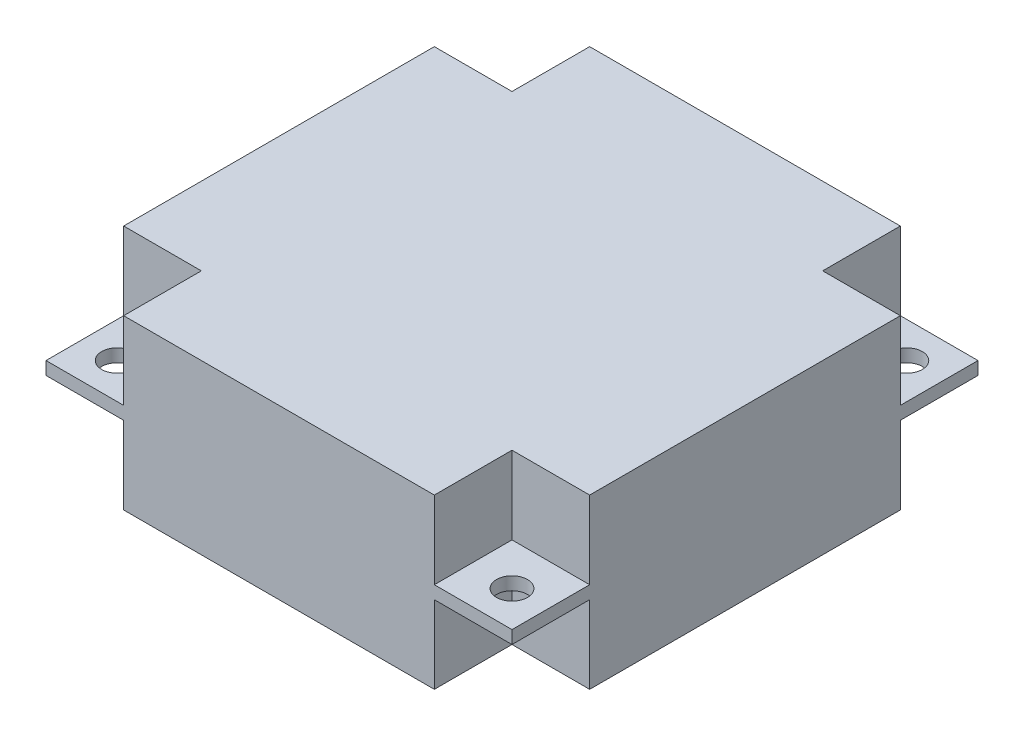
ISO-10303-21;
HEADER;
FILE_DESCRIPTION(('STEP AP214'),'2;1');
FILE_NAME('part.step','',(''),(''),'','','');
FILE_SCHEMA(('AUTOMOTIVE_DESIGN { 1 0 10303 214 1 1 1 1 }'));
ENDSEC;
DATA;
#1=APPLICATION_CONTEXT('core data for automotive mechanical design processes');
#2=APPLICATION_PROTOCOL_DEFINITION('international standard','automotive_design',2000,#1);
#3=PRODUCT_CONTEXT('',#1,'mechanical');
#4=PRODUCT('Part','Part','',(#3));
#5=PRODUCT_RELATED_PRODUCT_CATEGORY('part','',(#4));
#6=PRODUCT_DEFINITION_FORMATION('','',#4);
#7=PRODUCT_DEFINITION_CONTEXT('part definition',#1,'design');
#8=PRODUCT_DEFINITION('design','',#6,#7);
#9=PRODUCT_DEFINITION_SHAPE('','',#8);
#10=(LENGTH_UNIT() NAMED_UNIT(*) SI_UNIT(.MILLI.,.METRE.));
#11=(NAMED_UNIT(*) PLANE_ANGLE_UNIT() SI_UNIT($,.RADIAN.));
#12=(NAMED_UNIT(*) SI_UNIT($,.STERADIAN.) SOLID_ANGLE_UNIT());
#13=UNCERTAINTY_MEASURE_WITH_UNIT(LENGTH_MEASURE(1.E-05),#10,'distance_accuracy_value','');
#14=(GEOMETRIC_REPRESENTATION_CONTEXT(3) GLOBAL_UNCERTAINTY_ASSIGNED_CONTEXT((#13)) GLOBAL_UNIT_ASSIGNED_CONTEXT((#10,
#11,#12)) REPRESENTATION_CONTEXT('',''));
#15=CARTESIAN_POINT('',(0.,0.,0.));
#16=DIRECTION('',(0.,0.,1.));
#17=DIRECTION('',(1.,0.,0.));
#18=AXIS2_PLACEMENT_3D('',#15,#16,#17);
#19=CARTESIAN_POINT('',(0.,0.,0.));
#20=DIRECTION('',(0.,-1.,0.));
#21=DIRECTION('',(0.,0.,-1.));
#22=AXIS2_PLACEMENT_3D('',#19,#20,#21);
#23=PLANE('',#22);
#24=DIRECTION('',(1.,0.,0.));
#25=VECTOR('',#24,1.);
#26=CARTESIAN_POINT('',(0.,0.,-30.));
#27=LINE('',#26,#25);
#28=CARTESIAN_POINT('',(0.,0.,-30.));
#29=VERTEX_POINT('',#28);
#30=CARTESIAN_POINT('',(6.,0.,-30.));
#31=VERTEX_POINT('',#30);
#32=EDGE_CURVE('E354',#29,#31,#27,.T.);
#33=ORIENTED_EDGE('',*,*,#32,.F.);
#34=DIRECTION('',(0.,0.,1.));
#35=VECTOR('',#34,1.);
#36=CARTESIAN_POINT('',(0.,0.,0.));
#37=LINE('',#36,#35);
#38=CARTESIAN_POINT('',(0.,0.,-36.));
#39=VERTEX_POINT('',#38);
#40=EDGE_CURVE('E397',#39,#29,#37,.T.);
#41=ORIENTED_EDGE('',*,*,#40,.F.);
#42=DIRECTION('',(-1.,0.,0.));
#43=VECTOR('',#42,1.);
#44=CARTESIAN_POINT('',(0.,0.,-36.));
#45=LINE('',#44,#43);
#46=CARTESIAN_POINT('',(6.,0.,-36.));
#47=VERTEX_POINT('',#46);
#48=EDGE_CURVE('E408',#47,#39,#45,.T.);
#49=ORIENTED_EDGE('',*,*,#48,.F.);
#50=DIRECTION('',(0.,0.,1.));
#51=VECTOR('',#50,1.);
#52=CARTESIAN_POINT('',(6.,0.,0.));
#53=LINE('',#52,#51);
#54=EDGE_CURVE('E351',#47,#31,#53,.T.);
#55=ORIENTED_EDGE('',*,*,#54,.T.);
#56=EDGE_LOOP('',(#33,#41,#49,#55));
#57=FACE_BOUND('',#56,.T.);
#58=CARTESIAN_POINT('',(2.75,0.,-33.25));
#59=DIRECTION('',(0.,1.,0.));
#60=DIRECTION('',(0.,0.,1.));
#61=AXIS2_PLACEMENT_3D('',#58,#59,#60);
#62=CIRCLE('',#61,1.2);
#63=CARTESIAN_POINT('',(2.75,0.,-32.05));
#64=VERTEX_POINT('',#63);
#65=EDGE_CURVE('E368',#64,#64,#62,.T.);
#66=ORIENTED_EDGE('',*,*,#65,.T.);
#67=EDGE_LOOP('',(#66));
#68=FACE_BOUND('',#67,.T.);
#69=ADVANCED_FACE('F32',(#57,#68),#23,.T.);
#70=CARTESIAN_POINT('',(33.25,0.,-2.75));
#71=DIRECTION('',(0.,1.,0.));
#72=DIRECTION('',(0.,0.,1.));
#73=AXIS2_PLACEMENT_3D('',#70,#71,#72);
#74=CIRCLE('',#73,1.2);
#75=CARTESIAN_POINT('',(33.25,0.,-1.55));
#76=VERTEX_POINT('',#75);
#77=EDGE_CURVE('E380',#76,#76,#74,.T.);
#78=ORIENTED_EDGE('',*,*,#77,.T.);
#79=EDGE_LOOP('',(#78));
#80=FACE_BOUND('',#79,.T.);
#81=DIRECTION('',(0.,0.,1.));
#82=VECTOR('',#81,1.);
#83=CARTESIAN_POINT('',(30.,0.,0.));
#84=LINE('',#83,#82);
#85=CARTESIAN_POINT('',(30.,0.,-6.));
#86=VERTEX_POINT('',#85);
#87=CARTESIAN_POINT('',(30.,0.,0.));
#88=VERTEX_POINT('',#87);
#89=EDGE_CURVE('E342',#86,#88,#84,.T.);
#90=ORIENTED_EDGE('',*,*,#89,.F.);
#91=DIRECTION('',(1.,0.,0.));
#92=VECTOR('',#91,1.);
#93=CARTESIAN_POINT('',(0.,0.,-5.99999999999999));
#94=LINE('',#93,#92);
#95=CARTESIAN_POINT('',(36.,0.,-6.));
#96=VERTEX_POINT('',#95);
#97=EDGE_CURVE('E344',#86,#96,#94,.T.);
#98=ORIENTED_EDGE('',*,*,#97,.T.);
#99=DIRECTION('',(0.,0.,-1.));
#100=VECTOR('',#99,1.);
#101=CARTESIAN_POINT('',(36.,0.,0.));
#102=LINE('',#101,#100);
#103=CARTESIAN_POINT('',(36.,0.,0.));
#104=VERTEX_POINT('',#103);
#105=EDGE_CURVE('E405',#104,#96,#102,.T.);
#106=ORIENTED_EDGE('',*,*,#105,.F.);
#107=DIRECTION('',(1.,0.,0.));
#108=VECTOR('',#107,1.);
#109=CARTESIAN_POINT('',(0.,0.,0.));
#110=LINE('',#109,#108);
#111=EDGE_CURVE('E400',#88,#104,#110,.T.);
#112=ORIENTED_EDGE('',*,*,#111,.F.);
#113=EDGE_LOOP('',(#90,#98,#106,#112));
#114=FACE_BOUND('',#113,.T.);
#115=ADVANCED_FACE('F536',(#80,#114),#23,.T.);
#116=CARTESIAN_POINT('',(2.75,0.,-2.75));
#117=DIRECTION('',(0.,1.,0.));
#118=DIRECTION('',(0.,0.,1.));
#119=AXIS2_PLACEMENT_3D('',#116,#117,#118);
#120=CIRCLE('',#119,1.2);
#121=CARTESIAN_POINT('',(2.75,0.,-1.55));
#122=VERTEX_POINT('',#121);
#123=EDGE_CURVE('E362',#122,#122,#120,.T.);
#124=ORIENTED_EDGE('',*,*,#123,.T.);
#125=EDGE_LOOP('',(#124));
#126=FACE_BOUND('',#125,.T.);
#127=CARTESIAN_POINT('',(0.,0.,-6.));
#128=VERTEX_POINT('',#127);
#129=CARTESIAN_POINT('',(0.,0.,0.));
#130=VERTEX_POINT('',#129);
#131=EDGE_CURVE('E383',#128,#130,#37,.T.);
#132=ORIENTED_EDGE('',*,*,#131,.F.);
#133=DIRECTION('',(1.,0.,0.));
#134=VECTOR('',#133,1.);
#135=CARTESIAN_POINT('',(0.,0.,-5.99999999999999));
#136=LINE('',#135,#134);
#137=CARTESIAN_POINT('',(6.,0.,-6.));
#138=VERTEX_POINT('',#137);
#139=EDGE_CURVE('E356',#128,#138,#136,.T.);
#140=ORIENTED_EDGE('',*,*,#139,.T.);
#141=DIRECTION('',(0.,0.,1.));
#142=VECTOR('',#141,1.);
#143=CARTESIAN_POINT('',(6.,0.,0.));
#144=LINE('',#143,#142);
#145=CARTESIAN_POINT('',(6.,0.,0.));
#146=VERTEX_POINT('',#145);
#147=EDGE_CURVE('E304',#138,#146,#144,.T.);
#148=ORIENTED_EDGE('',*,*,#147,.T.);
#149=EDGE_CURVE('E401',#130,#146,#110,.T.);
#150=ORIENTED_EDGE('',*,*,#149,.F.);
#151=EDGE_LOOP('',(#132,#140,#148,#150));
#152=FACE_BOUND('',#151,.T.);
#153=ADVANCED_FACE('F550',(#126,#152),#23,.T.);
#154=CARTESIAN_POINT('',(0.,1.,0.));
#155=DIRECTION('',(0.,-1.,0.));
#156=DIRECTION('',(0.,0.,-1.));
#157=AXIS2_PLACEMENT_3D('',#154,#155,#156);
#158=PLANE('',#157);
#159=CARTESIAN_POINT('',(2.75,1.,-33.25));
#160=DIRECTION('',(0.,1.,0.));
#161=DIRECTION('',(0.,0.,1.));
#162=AXIS2_PLACEMENT_3D('',#159,#160,#161);
#163=CIRCLE('',#162,1.19999999999999);
#164=CARTESIAN_POINT('',(2.75,1.,-32.05));
#165=VERTEX_POINT('',#164);
#166=EDGE_CURVE('E365',#165,#165,#163,.T.);
#167=ORIENTED_EDGE('',*,*,#166,.F.);
#168=EDGE_LOOP('',(#167));
#169=FACE_BOUND('',#168,.T.);
#170=DIRECTION('',(0.,0.,1.));
#171=VECTOR('',#170,1.);
#172=CARTESIAN_POINT('',(0.,1.,0.));
#173=LINE('',#172,#171);
#174=CARTESIAN_POINT('',(0.,1.,-36.));
#175=VERTEX_POINT('',#174);
#176=CARTESIAN_POINT('',(0.,1.,-30.));
#177=VERTEX_POINT('',#176);
#178=EDGE_CURVE('E384',#175,#177,#173,.T.);
#179=ORIENTED_EDGE('',*,*,#178,.T.);
#180=DIRECTION('',(1.,0.,0.));
#181=VECTOR('',#180,1.);
#182=CARTESIAN_POINT('',(0.,1.,-30.));
#183=LINE('',#182,#181);
#184=CARTESIAN_POINT('',(6.,1.,-30.));
#185=VERTEX_POINT('',#184);
#186=EDGE_CURVE('E11',#177,#185,#183,.T.);
#187=ORIENTED_EDGE('',*,*,#186,.T.);
#188=DIRECTION('',(0.,0.,1.));
#189=VECTOR('',#188,1.);
#190=CARTESIAN_POINT('',(6.,1.,0.));
#191=LINE('',#190,#189);
#192=CARTESIAN_POINT('',(6.,1.,-36.));
#193=VERTEX_POINT('',#192);
#194=EDGE_CURVE('E40',#193,#185,#191,.T.);
#195=ORIENTED_EDGE('',*,*,#194,.F.);
#196=DIRECTION('',(-1.,0.,0.));
#197=VECTOR('',#196,1.);
#198=CARTESIAN_POINT('',(0.,1.,-36.));
#199=LINE('',#198,#197);
#200=EDGE_CURVE('E393',#193,#175,#199,.T.);
#201=ORIENTED_EDGE('',*,*,#200,.T.);
#202=EDGE_LOOP('',(#179,#187,#195,#201));
#203=FACE_BOUND('',#202,.T.);
#204=ADVANCED_FACE('F452',(#169,#203),#158,.F.);
#205=CARTESIAN_POINT('',(33.25,1.,-2.75));
#206=DIRECTION('',(0.,1.,0.));
#207=DIRECTION('',(0.,0.,1.));
#208=AXIS2_PLACEMENT_3D('',#205,#206,#207);
#209=CIRCLE('',#208,1.19999999999999);
#210=CARTESIAN_POINT('',(33.25,1.,-1.55000000000001));
#211=VERTEX_POINT('',#210);
#212=EDGE_CURVE('E377',#211,#211,#209,.T.);
#213=ORIENTED_EDGE('',*,*,#212,.F.);
#214=EDGE_LOOP('',(#213));
#215=FACE_BOUND('',#214,.T.);
#216=DIRECTION('',(1.,0.,0.));
#217=VECTOR('',#216,1.);
#218=CARTESIAN_POINT('',(0.,1.,-5.99999999999999));
#219=LINE('',#218,#217);
#220=CARTESIAN_POINT('',(30.,1.,-6.));
#221=VERTEX_POINT('',#220);
#222=CARTESIAN_POINT('',(36.,1.,-6.));
#223=VERTEX_POINT('',#222);
#224=EDGE_CURVE('E428',#221,#223,#219,.T.);
#225=ORIENTED_EDGE('',*,*,#224,.F.);
#226=DIRECTION('',(0.,0.,1.));
#227=VECTOR('',#226,1.);
#228=CARTESIAN_POINT('',(30.,1.,0.));
#229=LINE('',#228,#227);
#230=CARTESIAN_POINT('',(30.,1.,0.));
#231=VERTEX_POINT('',#230);
#232=EDGE_CURVE('E426',#221,#231,#229,.T.);
#233=ORIENTED_EDGE('',*,*,#232,.T.);
#234=DIRECTION('',(1.,0.,0.));
#235=VECTOR('',#234,1.);
#236=CARTESIAN_POINT('',(0.,1.,0.));
#237=LINE('',#236,#235);
#238=CARTESIAN_POINT('',(36.,1.,0.));
#239=VERTEX_POINT('',#238);
#240=EDGE_CURVE('E386',#231,#239,#237,.T.);
#241=ORIENTED_EDGE('',*,*,#240,.T.);
#242=DIRECTION('',(0.,0.,-1.));
#243=VECTOR('',#242,1.);
#244=CARTESIAN_POINT('',(36.,1.,0.));
#245=LINE('',#244,#243);
#246=EDGE_CURVE('E391',#239,#223,#245,.T.);
#247=ORIENTED_EDGE('',*,*,#246,.T.);
#248=EDGE_LOOP('',(#225,#233,#241,#247));
#249=FACE_BOUND('',#248,.T.);
#250=ADVANCED_FACE('F549',(#215,#249),#158,.F.);
#251=CARTESIAN_POINT('',(2.75,1.,-2.75));
#252=DIRECTION('',(0.,1.,0.));
#253=DIRECTION('',(0.,0.,1.));
#254=AXIS2_PLACEMENT_3D('',#251,#252,#253);
#255=CIRCLE('',#254,1.19999999999999);
#256=CARTESIAN_POINT('',(2.75,1.,-1.55000000000001));
#257=VERTEX_POINT('',#256);
#258=EDGE_CURVE('E359',#257,#257,#255,.T.);
#259=ORIENTED_EDGE('',*,*,#258,.F.);
#260=EDGE_LOOP('',(#259));
#261=FACE_BOUND('',#260,.T.);
#262=DIRECTION('',(1.,0.,0.));
#263=VECTOR('',#262,1.);
#264=CARTESIAN_POINT('',(0.,1.,-5.99999999999999));
#265=LINE('',#264,#263);
#266=CARTESIAN_POINT('',(0.,1.,-6.));
#267=VERTEX_POINT('',#266);
#268=CARTESIAN_POINT('',(6.,1.,-6.));
#269=VERTEX_POINT('',#268);
#270=EDGE_CURVE('E221',#267,#269,#265,.T.);
#271=ORIENTED_EDGE('',*,*,#270,.F.);
#272=CARTESIAN_POINT('',(0.,1.,0.));
#273=VERTEX_POINT('',#272);
#274=EDGE_CURVE('E387',#267,#273,#173,.T.);
#275=ORIENTED_EDGE('',*,*,#274,.T.);
#276=CARTESIAN_POINT('',(6.,1.,0.));
#277=VERTEX_POINT('',#276);
#278=EDGE_CURVE('E388',#273,#277,#237,.T.);
#279=ORIENTED_EDGE('',*,*,#278,.T.);
#280=DIRECTION('',(0.,0.,1.));
#281=VECTOR('',#280,1.);
#282=CARTESIAN_POINT('',(6.,1.,0.));
#283=LINE('',#282,#281);
#284=EDGE_CURVE('E423',#269,#277,#283,.T.);
#285=ORIENTED_EDGE('',*,*,#284,.F.);
#286=EDGE_LOOP('',(#271,#275,#279,#285));
#287=FACE_BOUND('',#286,.T.);
#288=ADVANCED_FACE('F459',(#261,#287),#158,.F.);
#289=DIRECTION('',(0.,0.,1.));
#290=VECTOR('',#289,1.);
#291=CARTESIAN_POINT('',(30.,0.,0.));
#292=LINE('',#291,#290);
#293=CARTESIAN_POINT('',(30.,0.,-36.));
#294=VERTEX_POINT('',#293);
#295=CARTESIAN_POINT('',(30.,0.,-30.));
#296=VERTEX_POINT('',#295);
#297=EDGE_CURVE('E349',#294,#296,#292,.T.);
#298=ORIENTED_EDGE('',*,*,#297,.F.);
#299=CARTESIAN_POINT('',(36.,0.,-36.));
#300=VERTEX_POINT('',#299);
#301=EDGE_CURVE('E409',#300,#294,#45,.T.);
#302=ORIENTED_EDGE('',*,*,#301,.F.);
#303=CARTESIAN_POINT('',(36.,0.,-30.));
#304=VERTEX_POINT('',#303);
#305=EDGE_CURVE('E404',#304,#300,#102,.T.);
#306=ORIENTED_EDGE('',*,*,#305,.F.);
#307=DIRECTION('',(1.,0.,0.));
#308=VECTOR('',#307,1.);
#309=CARTESIAN_POINT('',(0.,0.,-30.));
#310=LINE('',#309,#308);
#311=EDGE_CURVE('E347',#296,#304,#310,.T.);
#312=ORIENTED_EDGE('',*,*,#311,.F.);
#313=EDGE_LOOP('',(#298,#302,#306,#312));
#314=FACE_BOUND('',#313,.T.);
#315=CARTESIAN_POINT('',(33.25,0.,-33.25));
#316=DIRECTION('',(0.,1.,0.));
#317=DIRECTION('',(0.,0.,1.));
#318=AXIS2_PLACEMENT_3D('',#315,#316,#317);
#319=CIRCLE('',#318,1.2);
#320=CARTESIAN_POINT('',(33.25,0.,-32.05));
#321=VERTEX_POINT('',#320);
#322=EDGE_CURVE('E374',#321,#321,#319,.T.);
#323=ORIENTED_EDGE('',*,*,#322,.T.);
#324=EDGE_LOOP('',(#323));
#325=FACE_BOUND('',#324,.T.);
#326=ADVANCED_FACE('F492',(#314,#325),#23,.T.);
#327=CARTESIAN_POINT('',(0.,1.,0.));
#328=DIRECTION('',(1.,0.,0.));
#329=DIRECTION('',(0.,0.,-1.));
#330=AXIS2_PLACEMENT_3D('',#327,#328,#329);
#331=PLANE('',#330);
#332=ORIENTED_EDGE('',*,*,#40,.T.);
#333=DIRECTION('',(0.,1.,0.));
#334=VECTOR('',#333,1.);
#335=CARTESIAN_POINT('',(0.,-6.,-30.));
#336=LINE('',#335,#334);
#337=CARTESIAN_POINT('',(0.,-6.,-30.));
#338=VERTEX_POINT('',#337);
#339=EDGE_CURVE('E306',#338,#29,#336,.T.);
#340=ORIENTED_EDGE('',*,*,#339,.F.);
#341=DIRECTION('',(0.,0.,1.));
#342=VECTOR('',#341,1.);
#343=CARTESIAN_POINT('',(0.,-6.,0.));
#344=LINE('',#343,#342);
#345=CARTESIAN_POINT('',(0.,-6.,-6.));
#346=VERTEX_POINT('',#345);
#347=EDGE_CURVE('E226',#338,#346,#344,.T.);
#348=ORIENTED_EDGE('',*,*,#347,.T.);
#349=DIRECTION('',(0.,1.,0.));
#350=VECTOR('',#349,1.);
#351=CARTESIAN_POINT('',(0.,-6.,-6.));
#352=LINE('',#351,#350);
#353=EDGE_CURVE('E301',#346,#128,#352,.T.);
#354=ORIENTED_EDGE('',*,*,#353,.T.);
#355=ORIENTED_EDGE('',*,*,#131,.T.);
#356=DIRECTION('',(0.,-1.,0.));
#357=VECTOR('',#356,1.);
#358=CARTESIAN_POINT('',(0.,1.,0.));
#359=LINE('',#358,#357);
#360=EDGE_CURVE('E420',#273,#130,#359,.T.);
#361=ORIENTED_EDGE('',*,*,#360,.F.);
#362=ORIENTED_EDGE('',*,*,#274,.F.);
#363=CARTESIAN_POINT('',(0.,7.,-6.));
#364=VERTEX_POINT('',#363);
#365=EDGE_CURVE('E305',#267,#364,#352,.T.);
#366=ORIENTED_EDGE('',*,*,#365,.T.);
#367=DIRECTION('',(0.,0.,1.));
#368=VECTOR('',#367,1.);
#369=CARTESIAN_POINT('',(0.,7.,0.));
#370=LINE('',#369,#368);
#371=CARTESIAN_POINT('',(0.,7.,-30.));
#372=VERTEX_POINT('',#371);
#373=EDGE_CURVE('E236',#372,#364,#370,.T.);
#374=ORIENTED_EDGE('',*,*,#373,.F.);
#375=EDGE_CURVE('E308',#177,#372,#336,.T.);
#376=ORIENTED_EDGE('',*,*,#375,.F.);
#377=ORIENTED_EDGE('',*,*,#178,.F.);
#378=DIRECTION('',(0.,-1.,0.));
#379=VECTOR('',#378,1.);
#380=CARTESIAN_POINT('',(0.,1.,-36.));
#381=LINE('',#380,#379);
#382=EDGE_CURVE('E396',#175,#39,#381,.T.);
#383=ORIENTED_EDGE('',*,*,#382,.T.);
#384=EDGE_LOOP('',(#332,#340,#348,#354,#355,#361,#362,#366,#374,#376,#377,#383));
#385=FACE_BOUND('',#384,.T.);
#386=ADVANCED_FACE('F34',(#385),#331,.F.);
#387=CARTESIAN_POINT('',(0.,1.,0.));
#388=DIRECTION('',(0.,0.,-1.));
#389=DIRECTION('',(-1.,0.,0.));
#390=AXIS2_PLACEMENT_3D('',#387,#388,#389);
#391=PLANE('',#390);
#392=ORIENTED_EDGE('',*,*,#240,.F.);
#393=DIRECTION('',(0.,1.,0.));
#394=VECTOR('',#393,1.);
#395=CARTESIAN_POINT('',(30.,-6.,0.));
#396=LINE('',#395,#394);
#397=CARTESIAN_POINT('',(30.,7.,0.));
#398=VERTEX_POINT('',#397);
#399=EDGE_CURVE('E338',#231,#398,#396,.T.);
#400=ORIENTED_EDGE('',*,*,#399,.T.);
#401=DIRECTION('',(1.,0.,0.));
#402=VECTOR('',#401,1.);
#403=CARTESIAN_POINT('',(0.,7.,0.));
#404=LINE('',#403,#402);
#405=CARTESIAN_POINT('',(6.,7.,0.));
#406=VERTEX_POINT('',#405);
#407=EDGE_CURVE('E242',#406,#398,#404,.T.);
#408=ORIENTED_EDGE('',*,*,#407,.F.);
#409=DIRECTION('',(0.,1.,0.));
#410=VECTOR('',#409,1.);
#411=CARTESIAN_POINT('',(6.,-6.,0.));
#412=LINE('',#411,#410);
#413=EDGE_CURVE('E240',#277,#406,#412,.T.);
#414=ORIENTED_EDGE('',*,*,#413,.F.);
#415=ORIENTED_EDGE('',*,*,#278,.F.);
#416=ORIENTED_EDGE('',*,*,#360,.T.);
#417=ORIENTED_EDGE('',*,*,#149,.T.);
#418=CARTESIAN_POINT('',(6.,-6.,0.));
#419=VERTEX_POINT('',#418);
#420=EDGE_CURVE('E47',#419,#146,#412,.T.);
#421=ORIENTED_EDGE('',*,*,#420,.F.);
#422=DIRECTION('',(1.,0.,0.));
#423=VECTOR('',#422,1.);
#424=CARTESIAN_POINT('',(0.,-6.,0.));
#425=LINE('',#424,#423);
#426=CARTESIAN_POINT('',(30.,-6.,0.));
#427=VERTEX_POINT('',#426);
#428=EDGE_CURVE('E274',#419,#427,#425,.T.);
#429=ORIENTED_EDGE('',*,*,#428,.T.);
#430=EDGE_CURVE('E335',#427,#88,#396,.T.);
#431=ORIENTED_EDGE('',*,*,#430,.T.);
#432=ORIENTED_EDGE('',*,*,#111,.T.);
#433=DIRECTION('',(0.,-1.,0.));
#434=VECTOR('',#433,1.);
#435=CARTESIAN_POINT('',(36.,1.,0.));
#436=LINE('',#435,#434);
#437=EDGE_CURVE('E417',#239,#104,#436,.T.);
#438=ORIENTED_EDGE('',*,*,#437,.F.);
#439=EDGE_LOOP('',(#392,#400,#408,#414,#415,#416,#417,#421,#429,#431,#432,#438));
#440=FACE_BOUND('',#439,.T.);
#441=ADVANCED_FACE('F462',(#440),#391,.F.);
#442=CARTESIAN_POINT('',(36.,1.,0.));
#443=DIRECTION('',(-1.,0.,0.));
#444=DIRECTION('',(0.,0.,1.));
#445=AXIS2_PLACEMENT_3D('',#442,#443,#444);
#446=PLANE('',#445);
#447=CARTESIAN_POINT('',(36.,1.,-30.));
#448=VERTEX_POINT('',#447);
#449=CARTESIAN_POINT('',(36.,1.,-36.));
#450=VERTEX_POINT('',#449);
#451=EDGE_CURVE('E390',#448,#450,#245,.T.);
#452=ORIENTED_EDGE('',*,*,#451,.F.);
#453=DIRECTION('',(0.,1.,0.));
#454=VECTOR('',#453,1.);
#455=CARTESIAN_POINT('',(36.,-6.,-30.));
#456=LINE('',#455,#454);
#457=CARTESIAN_POINT('',(36.,7.,-30.));
#458=VERTEX_POINT('',#457);
#459=EDGE_CURVE('E327',#448,#458,#456,.T.);
#460=ORIENTED_EDGE('',*,*,#459,.T.);
#461=DIRECTION('',(0.,0.,-1.));
#462=VECTOR('',#461,1.);
#463=CARTESIAN_POINT('',(36.,7.,0.));
#464=LINE('',#463,#462);
#465=CARTESIAN_POINT('',(36.,7.,-6.));
#466=VERTEX_POINT('',#465);
#467=EDGE_CURVE('E252',#466,#458,#464,.T.);
#468=ORIENTED_EDGE('',*,*,#467,.F.);
#469=DIRECTION('',(0.,1.,0.));
#470=VECTOR('',#469,1.);
#471=CARTESIAN_POINT('',(36.,-6.,-6.));
#472=LINE('',#471,#470);
#473=EDGE_CURVE('E330',#223,#466,#472,.T.);
#474=ORIENTED_EDGE('',*,*,#473,.F.);
#475=ORIENTED_EDGE('',*,*,#246,.F.);
#476=ORIENTED_EDGE('',*,*,#437,.T.);
#477=ORIENTED_EDGE('',*,*,#105,.T.);
#478=CARTESIAN_POINT('',(36.,-6.,-6.));
#479=VERTEX_POINT('',#478);
#480=EDGE_CURVE('E328',#479,#96,#472,.T.);
#481=ORIENTED_EDGE('',*,*,#480,.F.);
#482=DIRECTION('',(0.,0.,-1.));
#483=VECTOR('',#482,1.);
#484=CARTESIAN_POINT('',(36.,-6.,0.));
#485=LINE('',#484,#483);
#486=CARTESIAN_POINT('',(36.,-6.,-30.));
#487=VERTEX_POINT('',#486);
#488=EDGE_CURVE('E282',#479,#487,#485,.T.);
#489=ORIENTED_EDGE('',*,*,#488,.T.);
#490=EDGE_CURVE('E324',#487,#304,#456,.T.);
#491=ORIENTED_EDGE('',*,*,#490,.T.);
#492=ORIENTED_EDGE('',*,*,#305,.T.);
#493=DIRECTION('',(0.,-1.,0.));
#494=VECTOR('',#493,1.);
#495=CARTESIAN_POINT('',(36.,1.,-36.));
#496=LINE('',#495,#494);
#497=EDGE_CURVE('E414',#450,#300,#496,.T.);
#498=ORIENTED_EDGE('',*,*,#497,.F.);
#499=EDGE_LOOP('',(#452,#460,#468,#474,#475,#476,#477,#481,#489,#491,#492,#498));
#500=FACE_BOUND('',#499,.T.);
#501=ADVANCED_FACE('F505',(#500),#446,.F.);
#502=CARTESIAN_POINT('',(0.,1.,-36.));
#503=DIRECTION('',(0.,0.,1.));
#504=DIRECTION('',(1.,0.,0.));
#505=AXIS2_PLACEMENT_3D('',#502,#503,#504);
#506=PLANE('',#505);
#507=ORIENTED_EDGE('',*,*,#301,.T.);
#508=DIRECTION('',(0.,1.,0.));
#509=VECTOR('',#508,1.);
#510=CARTESIAN_POINT('',(30.,-6.,-36.));
#511=LINE('',#510,#509);
#512=CARTESIAN_POINT('',(30.,-6.,-36.));
#513=VERTEX_POINT('',#512);
#514=EDGE_CURVE('E317',#513,#294,#511,.T.);
#515=ORIENTED_EDGE('',*,*,#514,.F.);
#516=DIRECTION('',(-1.,0.,0.));
#517=VECTOR('',#516,1.);
#518=CARTESIAN_POINT('',(0.,-6.,-36.));
#519=LINE('',#518,#517);
#520=CARTESIAN_POINT('',(6.,-6.,-36.));
#521=VERTEX_POINT('',#520);
#522=EDGE_CURVE('E291',#513,#521,#519,.T.);
#523=ORIENTED_EDGE('',*,*,#522,.T.);
#524=DIRECTION('',(0.,1.,0.));
#525=VECTOR('',#524,1.);
#526=CARTESIAN_POINT('',(6.,-6.,-36.));
#527=LINE('',#526,#525);
#528=EDGE_CURVE('E313',#521,#47,#527,.T.);
#529=ORIENTED_EDGE('',*,*,#528,.T.);
#530=ORIENTED_EDGE('',*,*,#48,.T.);
#531=ORIENTED_EDGE('',*,*,#382,.F.);
#532=ORIENTED_EDGE('',*,*,#200,.F.);
#533=CARTESIAN_POINT('',(6.,7.,-36.));
#534=VERTEX_POINT('',#533);
#535=EDGE_CURVE('E316',#193,#534,#527,.T.);
#536=ORIENTED_EDGE('',*,*,#535,.T.);
#537=DIRECTION('',(-1.,0.,0.));
#538=VECTOR('',#537,1.);
#539=CARTESIAN_POINT('',(0.,7.,-36.));
#540=LINE('',#539,#538);
#541=CARTESIAN_POINT('',(30.,7.,-36.));
#542=VERTEX_POINT('',#541);
#543=EDGE_CURVE('E261',#542,#534,#540,.T.);
#544=ORIENTED_EDGE('',*,*,#543,.F.);
#545=CARTESIAN_POINT('',(30.,1.,-36.));
#546=VERTEX_POINT('',#545);
#547=EDGE_CURVE('E319',#546,#542,#511,.T.);
#548=ORIENTED_EDGE('',*,*,#547,.F.);
#549=EDGE_CURVE('E394',#450,#546,#199,.T.);
#550=ORIENTED_EDGE('',*,*,#549,.F.);
#551=ORIENTED_EDGE('',*,*,#497,.T.);
#552=EDGE_LOOP('',(#507,#515,#523,#529,#530,#531,#532,#536,#544,#548,#550,#551));
#553=FACE_BOUND('',#552,.T.);
#554=ADVANCED_FACE('F448',(#553),#506,.F.);
#555=CARTESIAN_POINT('',(33.25,1.,-33.25));
#556=DIRECTION('',(0.,1.,0.));
#557=DIRECTION('',(0.,0.,1.));
#558=AXIS2_PLACEMENT_3D('',#555,#556,#557);
#559=CIRCLE('',#558,1.19999999999999);
#560=CARTESIAN_POINT('',(33.25,1.,-32.05));
#561=VERTEX_POINT('',#560);
#562=EDGE_CURVE('E371',#561,#561,#559,.T.);
#563=ORIENTED_EDGE('',*,*,#562,.F.);
#564=EDGE_LOOP('',(#563));
#565=FACE_BOUND('',#564,.T.);
#566=ORIENTED_EDGE('',*,*,#549,.T.);
#567=DIRECTION('',(0.,0.,1.));
#568=VECTOR('',#567,1.);
#569=CARTESIAN_POINT('',(30.,1.,0.));
#570=LINE('',#569,#568);
#571=CARTESIAN_POINT('',(30.,1.,-30.));
#572=VERTEX_POINT('',#571);
#573=EDGE_CURVE('E433',#546,#572,#570,.T.);
#574=ORIENTED_EDGE('',*,*,#573,.T.);
#575=DIRECTION('',(1.,0.,0.));
#576=VECTOR('',#575,1.);
#577=CARTESIAN_POINT('',(0.,1.,-30.));
#578=LINE('',#577,#576);
#579=EDGE_CURVE('E431',#572,#448,#578,.T.);
#580=ORIENTED_EDGE('',*,*,#579,.T.);
#581=ORIENTED_EDGE('',*,*,#451,.T.);
#582=EDGE_LOOP('',(#566,#574,#580,#581));
#583=FACE_BOUND('',#582,.T.);
#584=ADVANCED_FACE('F485',(#565,#583),#158,.F.);
#585=CARTESIAN_POINT('',(33.25,1.,-2.75));
#586=DIRECTION('',(0.,1.,0.));
#587=DIRECTION('',(0.,0.,1.));
#588=AXIS2_PLACEMENT_3D('',#585,#586,#587);
#589=CYLINDRICAL_SURFACE('',#588,1.19999999999999);
#590=ORIENTED_EDGE('',*,*,#77,.F.);
#591=EDGE_LOOP('',(#590));
#592=FACE_BOUND('',#591,.T.);
#593=ORIENTED_EDGE('',*,*,#212,.T.);
#594=EDGE_LOOP('',(#593));
#595=FACE_BOUND('',#594,.T.);
#596=ADVANCED_FACE('F560',(#592,#595),#589,.F.);
#597=CARTESIAN_POINT('',(33.25,1.,-33.25));
#598=DIRECTION('',(0.,1.,0.));
#599=DIRECTION('',(0.,0.,1.));
#600=AXIS2_PLACEMENT_3D('',#597,#598,#599);
#601=CYLINDRICAL_SURFACE('',#600,1.19999999999999);
#602=ORIENTED_EDGE('',*,*,#322,.F.);
#603=EDGE_LOOP('',(#602));
#604=FACE_BOUND('',#603,.T.);
#605=ORIENTED_EDGE('',*,*,#562,.T.);
#606=EDGE_LOOP('',(#605));
#607=FACE_BOUND('',#606,.T.);
#608=ADVANCED_FACE('F544',(#604,#607),#601,.F.);
#609=CARTESIAN_POINT('',(2.75,1.,-33.25));
#610=DIRECTION('',(0.,1.,0.));
#611=DIRECTION('',(0.,0.,1.));
#612=AXIS2_PLACEMENT_3D('',#609,#610,#611);
#613=CYLINDRICAL_SURFACE('',#612,1.19999999999999);
#614=ORIENTED_EDGE('',*,*,#65,.F.);
#615=EDGE_LOOP('',(#614));
#616=FACE_BOUND('',#615,.T.);
#617=ORIENTED_EDGE('',*,*,#166,.T.);
#618=EDGE_LOOP('',(#617));
#619=FACE_BOUND('',#618,.T.);
#620=ADVANCED_FACE('F540',(#616,#619),#613,.F.);
#621=CARTESIAN_POINT('',(2.75,1.,-2.75));
#622=DIRECTION('',(0.,1.,0.));
#623=DIRECTION('',(0.,0.,1.));
#624=AXIS2_PLACEMENT_3D('',#621,#622,#623);
#625=CYLINDRICAL_SURFACE('',#624,1.19999999999999);
#626=ORIENTED_EDGE('',*,*,#123,.F.);
#627=EDGE_LOOP('',(#626));
#628=FACE_BOUND('',#627,.T.);
#629=ORIENTED_EDGE('',*,*,#258,.T.);
#630=EDGE_LOOP('',(#629));
#631=FACE_BOUND('',#630,.T.);
#632=ADVANCED_FACE('F543',(#628,#631),#625,.F.);
#633=CARTESIAN_POINT('',(0.,7.,0.));
#634=DIRECTION('',(0.,1.,0.));
#635=DIRECTION('',(0.,0.,1.));
#636=AXIS2_PLACEMENT_3D('',#633,#634,#635);
#637=PLANE('',#636);
#638=DIRECTION('',(-1.,0.,0.));
#639=VECTOR('',#638,1.);
#640=CARTESIAN_POINT('',(0.,7.,-5.99999999999999));
#641=LINE('',#640,#639);
#642=CARTESIAN_POINT('',(6.,7.,-6.));
#643=VERTEX_POINT('',#642);
#644=EDGE_CURVE('E220',#643,#364,#641,.T.);
#645=ORIENTED_EDGE('',*,*,#644,.F.);
#646=DIRECTION('',(0.,0.,-1.));
#647=VECTOR('',#646,1.);
#648=CARTESIAN_POINT('',(6.,7.,0.));
#649=LINE('',#648,#647);
#650=EDGE_CURVE('E233',#406,#643,#649,.T.);
#651=ORIENTED_EDGE('',*,*,#650,.F.);
#652=ORIENTED_EDGE('',*,*,#407,.T.);
#653=DIRECTION('',(0.,0.,-1.));
#654=VECTOR('',#653,1.);
#655=CARTESIAN_POINT('',(30.,7.,0.));
#656=LINE('',#655,#654);
#657=CARTESIAN_POINT('',(30.,7.,-6.));
#658=VERTEX_POINT('',#657);
#659=EDGE_CURVE('E244',#398,#658,#656,.T.);
#660=ORIENTED_EDGE('',*,*,#659,.T.);
#661=DIRECTION('',(-1.,0.,0.));
#662=VECTOR('',#661,1.);
#663=CARTESIAN_POINT('',(0.,7.,-5.99999999999999));
#664=LINE('',#663,#662);
#665=EDGE_CURVE('E249',#466,#658,#664,.T.);
#666=ORIENTED_EDGE('',*,*,#665,.F.);
#667=ORIENTED_EDGE('',*,*,#467,.T.);
#668=DIRECTION('',(-1.,0.,0.));
#669=VECTOR('',#668,1.);
#670=CARTESIAN_POINT('',(0.,7.,-30.));
#671=LINE('',#670,#669);
#672=CARTESIAN_POINT('',(30.,7.,-30.));
#673=VERTEX_POINT('',#672);
#674=EDGE_CURVE('E255',#458,#673,#671,.T.);
#675=ORIENTED_EDGE('',*,*,#674,.T.);
#676=DIRECTION('',(0.,0.,-1.));
#677=VECTOR('',#676,1.);
#678=CARTESIAN_POINT('',(30.,7.,0.));
#679=LINE('',#678,#677);
#680=EDGE_CURVE('E258',#673,#542,#679,.T.);
#681=ORIENTED_EDGE('',*,*,#680,.T.);
#682=ORIENTED_EDGE('',*,*,#543,.T.);
#683=DIRECTION('',(0.,0.,-1.));
#684=VECTOR('',#683,1.);
#685=CARTESIAN_POINT('',(6.,7.,0.));
#686=LINE('',#685,#684);
#687=CARTESIAN_POINT('',(6.,7.,-30.));
#688=VERTEX_POINT('',#687);
#689=EDGE_CURVE('E264',#688,#534,#686,.T.);
#690=ORIENTED_EDGE('',*,*,#689,.F.);
#691=DIRECTION('',(-1.,0.,0.));
#692=VECTOR('',#691,1.);
#693=CARTESIAN_POINT('',(0.,7.,-30.));
#694=LINE('',#693,#692);
#695=EDGE_CURVE('E267',#688,#372,#694,.T.);
#696=ORIENTED_EDGE('',*,*,#695,.T.);
#697=ORIENTED_EDGE('',*,*,#373,.T.);
#698=EDGE_LOOP('',(#645,#651,#652,#660,#666,#667,#675,#681,#682,#690,#696,#697));
#699=FACE_BOUND('',#698,.T.);
#700=ADVANCED_FACE('F231',(#699),#637,.T.);
#701=CARTESIAN_POINT('',(6.,-6.,0.));
#702=DIRECTION('',(1.,0.,0.));
#703=DIRECTION('',(0.,0.,-1.));
#704=AXIS2_PLACEMENT_3D('',#701,#702,#703);
#705=PLANE('',#704);
#706=DIRECTION('',(0.,1.,0.));
#707=VECTOR('',#706,1.);
#708=CARTESIAN_POINT('',(6.,-6.,-6.));
#709=LINE('',#708,#707);
#710=EDGE_CURVE('E216',#269,#643,#709,.T.);
#711=ORIENTED_EDGE('',*,*,#710,.F.);
#712=ORIENTED_EDGE('',*,*,#284,.T.);
#713=ORIENTED_EDGE('',*,*,#413,.T.);
#714=ORIENTED_EDGE('',*,*,#650,.T.);
#715=EDGE_LOOP('',(#711,#712,#713,#714));
#716=FACE_BOUND('',#715,.T.);
#717=ADVANCED_FACE('F238',(#716),#705,.F.);
#718=CARTESIAN_POINT('',(30.,-6.,0.));
#719=DIRECTION('',(1.,0.,0.));
#720=DIRECTION('',(0.,0.,-1.));
#721=AXIS2_PLACEMENT_3D('',#718,#719,#720);
#722=PLANE('',#721);
#723=ORIENTED_EDGE('',*,*,#232,.F.);
#724=DIRECTION('',(0.,1.,0.));
#725=VECTOR('',#724,1.);
#726=CARTESIAN_POINT('',(30.,-6.,-6.));
#727=LINE('',#726,#725);
#728=EDGE_CURVE('E334',#221,#658,#727,.T.);
#729=ORIENTED_EDGE('',*,*,#728,.T.);
#730=ORIENTED_EDGE('',*,*,#659,.F.);
#731=ORIENTED_EDGE('',*,*,#399,.F.);
#732=EDGE_LOOP('',(#723,#729,#730,#731));
#733=FACE_BOUND('',#732,.T.);
#734=ADVANCED_FACE('F468',(#733),#722,.T.);
#735=CARTESIAN_POINT('',(0.,-6.,-5.99999999999999));
#736=DIRECTION('',(0.,0.,-1.));
#737=DIRECTION('',(-1.,0.,0.));
#738=AXIS2_PLACEMENT_3D('',#735,#736,#737);
#739=PLANE('',#738);
#740=ORIENTED_EDGE('',*,*,#728,.F.);
#741=ORIENTED_EDGE('',*,*,#224,.T.);
#742=ORIENTED_EDGE('',*,*,#473,.T.);
#743=ORIENTED_EDGE('',*,*,#665,.T.);
#744=EDGE_LOOP('',(#740,#741,#742,#743));
#745=FACE_BOUND('',#744,.T.);
#746=ADVANCED_FACE('F471',(#745),#739,.F.);
#747=CARTESIAN_POINT('',(0.,-6.,-30.));
#748=DIRECTION('',(0.,0.,-1.));
#749=DIRECTION('',(-1.,0.,0.));
#750=AXIS2_PLACEMENT_3D('',#747,#748,#749);
#751=PLANE('',#750);
#752=ORIENTED_EDGE('',*,*,#579,.F.);
#753=DIRECTION('',(0.,1.,0.));
#754=VECTOR('',#753,1.);
#755=CARTESIAN_POINT('',(30.,-6.,-30.));
#756=LINE('',#755,#754);
#757=EDGE_CURVE('E323',#572,#673,#756,.T.);
#758=ORIENTED_EDGE('',*,*,#757,.T.);
#759=ORIENTED_EDGE('',*,*,#674,.F.);
#760=ORIENTED_EDGE('',*,*,#459,.F.);
#761=EDGE_LOOP('',(#752,#758,#759,#760));
#762=FACE_BOUND('',#761,.T.);
#763=ADVANCED_FACE('F479',(#762),#751,.T.);
#764=CARTESIAN_POINT('',(30.,-6.,0.));
#765=DIRECTION('',(1.,0.,0.));
#766=DIRECTION('',(0.,0.,-1.));
#767=AXIS2_PLACEMENT_3D('',#764,#765,#766);
#768=PLANE('',#767);
#769=ORIENTED_EDGE('',*,*,#573,.F.);
#770=ORIENTED_EDGE('',*,*,#547,.T.);
#771=ORIENTED_EDGE('',*,*,#680,.F.);
#772=ORIENTED_EDGE('',*,*,#757,.F.);
#773=EDGE_LOOP('',(#769,#770,#771,#772));
#774=FACE_BOUND('',#773,.T.);
#775=ADVANCED_FACE('F483',(#774),#768,.T.);
#776=CARTESIAN_POINT('',(6.,-6.,0.));
#777=DIRECTION('',(1.,0.,0.));
#778=DIRECTION('',(0.,0.,-1.));
#779=AXIS2_PLACEMENT_3D('',#776,#777,#778);
#780=PLANE('',#779);
#781=ORIENTED_EDGE('',*,*,#535,.F.);
#782=ORIENTED_EDGE('',*,*,#194,.T.);
#783=DIRECTION('',(0.,1.,0.));
#784=VECTOR('',#783,1.);
#785=CARTESIAN_POINT('',(6.,-6.,-30.));
#786=LINE('',#785,#784);
#787=EDGE_CURVE('E312',#185,#688,#786,.T.);
#788=ORIENTED_EDGE('',*,*,#787,.T.);
#789=ORIENTED_EDGE('',*,*,#689,.T.);
#790=EDGE_LOOP('',(#781,#782,#788,#789));
#791=FACE_BOUND('',#790,.T.);
#792=ADVANCED_FACE('F437',(#791),#780,.F.);
#793=CARTESIAN_POINT('',(0.,-6.,-30.));
#794=DIRECTION('',(0.,0.,-1.));
#795=DIRECTION('',(-1.,0.,0.));
#796=AXIS2_PLACEMENT_3D('',#793,#794,#795);
#797=PLANE('',#796);
#798=ORIENTED_EDGE('',*,*,#186,.F.);
#799=ORIENTED_EDGE('',*,*,#375,.T.);
#800=ORIENTED_EDGE('',*,*,#695,.F.);
#801=ORIENTED_EDGE('',*,*,#787,.F.);
#802=EDGE_LOOP('',(#798,#799,#800,#801));
#803=FACE_BOUND('',#802,.T.);
#804=ADVANCED_FACE('F441',(#803),#797,.T.);
#805=CARTESIAN_POINT('',(0.,-6.,-5.99999999999999));
#806=DIRECTION('',(0.,0.,-1.));
#807=DIRECTION('',(-1.,0.,0.));
#808=AXIS2_PLACEMENT_3D('',#805,#806,#807);
#809=PLANE('',#808);
#810=ORIENTED_EDGE('',*,*,#365,.F.);
#811=ORIENTED_EDGE('',*,*,#270,.T.);
#812=ORIENTED_EDGE('',*,*,#710,.T.);
#813=ORIENTED_EDGE('',*,*,#644,.T.);
#814=EDGE_LOOP('',(#810,#811,#812,#813));
#815=FACE_BOUND('',#814,.T.);
#816=ADVANCED_FACE('F219',(#815),#809,.F.);
#817=ORIENTED_EDGE('',*,*,#139,.F.);
#818=ORIENTED_EDGE('',*,*,#353,.F.);
#819=DIRECTION('',(-1.,0.,0.));
#820=VECTOR('',#819,1.);
#821=CARTESIAN_POINT('',(0.,-6.,-5.99999999999999));
#822=LINE('',#821,#820);
#823=CARTESIAN_POINT('',(6.,-6.,-6.));
#824=VERTEX_POINT('',#823);
#825=EDGE_CURVE('E270',#824,#346,#822,.T.);
#826=ORIENTED_EDGE('',*,*,#825,.F.);
#827=EDGE_CURVE('E225',#824,#138,#709,.T.);
#828=ORIENTED_EDGE('',*,*,#827,.T.);
#829=EDGE_LOOP('',(#817,#818,#826,#828));
#830=FACE_BOUND('',#829,.T.);
#831=ADVANCED_FACE('F523',(#830),#809,.F.);
#832=ORIENTED_EDGE('',*,*,#339,.T.);
#833=ORIENTED_EDGE('',*,*,#32,.T.);
#834=CARTESIAN_POINT('',(6.,-6.,-30.));
#835=VERTEX_POINT('',#834);
#836=EDGE_CURVE('E309',#835,#31,#786,.T.);
#837=ORIENTED_EDGE('',*,*,#836,.F.);
#838=DIRECTION('',(-1.,0.,0.));
#839=VECTOR('',#838,1.);
#840=CARTESIAN_POINT('',(0.,-6.,-30.));
#841=LINE('',#840,#839);
#842=EDGE_CURVE('E296',#835,#338,#841,.T.);
#843=ORIENTED_EDGE('',*,*,#842,.T.);
#844=EDGE_LOOP('',(#832,#833,#837,#843));
#845=FACE_BOUND('',#844,.T.);
#846=ADVANCED_FACE('F527',(#845),#797,.T.);
#847=ORIENTED_EDGE('',*,*,#54,.F.);
#848=ORIENTED_EDGE('',*,*,#528,.F.);
#849=DIRECTION('',(0.,0.,-1.));
#850=VECTOR('',#849,1.);
#851=CARTESIAN_POINT('',(6.,-6.,0.));
#852=LINE('',#851,#850);
#853=EDGE_CURVE('E294',#835,#521,#852,.T.);
#854=ORIENTED_EDGE('',*,*,#853,.F.);
#855=ORIENTED_EDGE('',*,*,#836,.T.);
#856=EDGE_LOOP('',(#847,#848,#854,#855));
#857=FACE_BOUND('',#856,.T.);
#858=ADVANCED_FACE('F531',(#857),#780,.F.);
#859=ORIENTED_EDGE('',*,*,#514,.T.);
#860=ORIENTED_EDGE('',*,*,#297,.T.);
#861=CARTESIAN_POINT('',(30.,-6.,-30.));
#862=VERTEX_POINT('',#861);
#863=EDGE_CURVE('E320',#862,#296,#756,.T.);
#864=ORIENTED_EDGE('',*,*,#863,.F.);
#865=DIRECTION('',(0.,0.,-1.));
#866=VECTOR('',#865,1.);
#867=CARTESIAN_POINT('',(30.,-6.,0.));
#868=LINE('',#867,#866);
#869=EDGE_CURVE('E288',#862,#513,#868,.T.);
#870=ORIENTED_EDGE('',*,*,#869,.T.);
#871=EDGE_LOOP('',(#859,#860,#864,#870));
#872=FACE_BOUND('',#871,.T.);
#873=ADVANCED_FACE('F496',(#872),#768,.T.);
#874=ORIENTED_EDGE('',*,*,#863,.T.);
#875=ORIENTED_EDGE('',*,*,#311,.T.);
#876=ORIENTED_EDGE('',*,*,#490,.F.);
#877=DIRECTION('',(-1.,0.,0.));
#878=VECTOR('',#877,1.);
#879=CARTESIAN_POINT('',(0.,-6.,-30.));
#880=LINE('',#879,#878);
#881=EDGE_CURVE('E285',#487,#862,#880,.T.);
#882=ORIENTED_EDGE('',*,*,#881,.T.);
#883=EDGE_LOOP('',(#874,#875,#876,#882));
#884=FACE_BOUND('',#883,.T.);
#885=ADVANCED_FACE('F499',(#884),#751,.T.);
#886=ORIENTED_EDGE('',*,*,#97,.F.);
#887=CARTESIAN_POINT('',(30.,-6.,-6.));
#888=VERTEX_POINT('',#887);
#889=EDGE_CURVE('E331',#888,#86,#727,.T.);
#890=ORIENTED_EDGE('',*,*,#889,.F.);
#891=DIRECTION('',(-1.,0.,0.));
#892=VECTOR('',#891,1.);
#893=CARTESIAN_POINT('',(0.,-6.,-5.99999999999999));
#894=LINE('',#893,#892);
#895=EDGE_CURVE('E280',#479,#888,#894,.T.);
#896=ORIENTED_EDGE('',*,*,#895,.F.);
#897=ORIENTED_EDGE('',*,*,#480,.T.);
#898=EDGE_LOOP('',(#886,#890,#896,#897));
#899=FACE_BOUND('',#898,.T.);
#900=ADVANCED_FACE('F510',(#899),#739,.F.);
#901=ORIENTED_EDGE('',*,*,#889,.T.);
#902=ORIENTED_EDGE('',*,*,#89,.T.);
#903=ORIENTED_EDGE('',*,*,#430,.F.);
#904=DIRECTION('',(0.,0.,-1.));
#905=VECTOR('',#904,1.);
#906=CARTESIAN_POINT('',(30.,-6.,0.));
#907=LINE('',#906,#905);
#908=EDGE_CURVE('E277',#427,#888,#907,.T.);
#909=ORIENTED_EDGE('',*,*,#908,.T.);
#910=EDGE_LOOP('',(#901,#902,#903,#909));
#911=FACE_BOUND('',#910,.T.);
#912=ADVANCED_FACE('F706',(#911),#722,.T.);
#913=ORIENTED_EDGE('',*,*,#147,.F.);
#914=ORIENTED_EDGE('',*,*,#827,.F.);
#915=DIRECTION('',(0.,0.,-1.));
#916=VECTOR('',#915,1.);
#917=CARTESIAN_POINT('',(6.,-6.,0.));
#918=LINE('',#917,#916);
#919=EDGE_CURVE('E272',#419,#824,#918,.T.);
#920=ORIENTED_EDGE('',*,*,#919,.F.);
#921=ORIENTED_EDGE('',*,*,#420,.T.);
#922=EDGE_LOOP('',(#913,#914,#920,#921));
#923=FACE_BOUND('',#922,.T.);
#924=ADVANCED_FACE('F517',(#923),#705,.F.);
#925=CARTESIAN_POINT('',(0.,-6.,0.));
#926=DIRECTION('',(0.,1.,0.));
#927=DIRECTION('',(0.,0.,1.));
#928=AXIS2_PLACEMENT_3D('',#925,#926,#927);
#929=PLANE('',#928);
#930=ORIENTED_EDGE('',*,*,#825,.T.);
#931=ORIENTED_EDGE('',*,*,#347,.F.);
#932=ORIENTED_EDGE('',*,*,#842,.F.);
#933=ORIENTED_EDGE('',*,*,#853,.T.);
#934=ORIENTED_EDGE('',*,*,#522,.F.);
#935=ORIENTED_EDGE('',*,*,#869,.F.);
#936=ORIENTED_EDGE('',*,*,#881,.F.);
#937=ORIENTED_EDGE('',*,*,#488,.F.);
#938=ORIENTED_EDGE('',*,*,#895,.T.);
#939=ORIENTED_EDGE('',*,*,#908,.F.);
#940=ORIENTED_EDGE('',*,*,#428,.F.);
#941=ORIENTED_EDGE('',*,*,#919,.T.);
#942=EDGE_LOOP('',(#930,#931,#932,#933,#934,#935,#936,#937,#938,#939,#940,#941));
#943=FACE_BOUND('',#942,.T.);
#944=ADVANCED_FACE('F503',(#943),#929,.F.);
#945=CLOSED_SHELL('',(#69,#115,#153,#204,#250,#288,#326,#386,#441,#501,#554,#584,#596,#608,#620,
#632,#700,#717,#734,#746,#763,#775,#792,#804,#816,#831,#846,#858,#873,#885,#900,#912,#924,#944));
#946=MANIFOLD_SOLID_BREP('B2',#945);
#947=ADVANCED_BREP_SHAPE_REPRESENTATION('',(#18,#946),#14);
#948=SHAPE_DEFINITION_REPRESENTATION(#9,#947);
ENDSEC;
END-ISO-10303-21;
